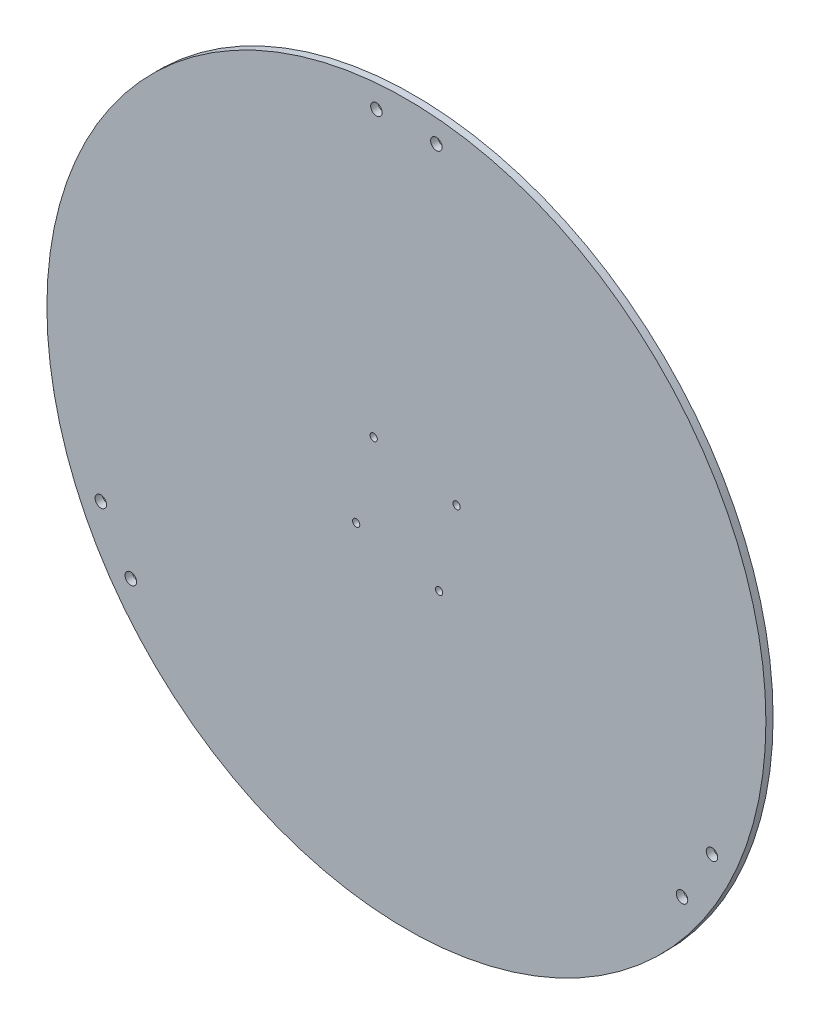
ISO-10303-21;
HEADER;
FILE_DESCRIPTION(('STEP AP214'),'2;1');
FILE_NAME('part.step','',(''),(''),'','','');
FILE_SCHEMA(('AUTOMOTIVE_DESIGN { 1 0 10303 214 1 1 1 1 }'));
ENDSEC;
DATA;
#1=APPLICATION_CONTEXT('core data for automotive mechanical design processes');
#2=APPLICATION_PROTOCOL_DEFINITION('international standard','automotive_design',2000,#1);
#3=PRODUCT_CONTEXT('',#1,'mechanical');
#4=PRODUCT('Part','Part','',(#3));
#5=PRODUCT_RELATED_PRODUCT_CATEGORY('part','',(#4));
#6=PRODUCT_DEFINITION_FORMATION('','',#4);
#7=PRODUCT_DEFINITION_CONTEXT('part definition',#1,'design');
#8=PRODUCT_DEFINITION('design','',#6,#7);
#9=PRODUCT_DEFINITION_SHAPE('','',#8);
#10=(LENGTH_UNIT() NAMED_UNIT(*) SI_UNIT(.MILLI.,.METRE.));
#11=(NAMED_UNIT(*) PLANE_ANGLE_UNIT() SI_UNIT($,.RADIAN.));
#12=(NAMED_UNIT(*) SI_UNIT($,.STERADIAN.) SOLID_ANGLE_UNIT());
#13=UNCERTAINTY_MEASURE_WITH_UNIT(LENGTH_MEASURE(1.E-05),#10,'distance_accuracy_value','');
#14=(GEOMETRIC_REPRESENTATION_CONTEXT(3) GLOBAL_UNCERTAINTY_ASSIGNED_CONTEXT((#13)) GLOBAL_UNIT_ASSIGNED_CONTEXT((#10,
#11,#12)) REPRESENTATION_CONTEXT('',''));
#15=CARTESIAN_POINT('',(0.,0.,0.));
#16=DIRECTION('',(0.,0.,1.));
#17=DIRECTION('',(1.,0.,0.));
#18=AXIS2_PLACEMENT_3D('',#15,#16,#17);
#19=CARTESIAN_POINT('',(0.,8.74300631892311E-13,3.));
#20=DIRECTION('',(0.,0.,1.));
#21=DIRECTION('',(1.,0.,0.));
#22=AXIS2_PLACEMENT_3D('',#19,#20,#21);
#23=PLANE('',#22);
#24=CARTESIAN_POINT('',(20.9486186436359,13.6438769022421,3.));
#25=DIRECTION('',(0.,0.,-1.));
#26=DIRECTION('',(-1.,0.,0.));
#27=AXIS2_PLACEMENT_3D('',#24,#25,#26);
#28=CIRCLE('',#27,1.5);
#29=CARTESIAN_POINT('',(19.4486186436359,13.6438769022421,3.));
#30=VERTEX_POINT('',#29);
#31=EDGE_CURVE('E140',#30,#30,#28,.T.);
#32=ORIENTED_EDGE('',*,*,#31,.T.);
#33=EDGE_LOOP('',(#32));
#34=FACE_BOUND('',#33,.T.);
#35=CARTESIAN_POINT('',(-13.6438769022413,20.9486186436367,3.));
#36=DIRECTION('',(0.,0.,-1.));
#37=DIRECTION('',(-1.,0.,0.));
#38=AXIS2_PLACEMENT_3D('',#35,#36,#37);
#39=CIRCLE('',#38,1.5);
#40=CARTESIAN_POINT('',(-15.1438769022413,20.9486186436367,3.));
#41=VERTEX_POINT('',#40);
#42=EDGE_CURVE('E128',#41,#41,#39,.T.);
#43=ORIENTED_EDGE('',*,*,#42,.T.);
#44=EDGE_LOOP('',(#43));
#45=FACE_BOUND('',#44,.T.);
#46=CARTESIAN_POINT('',(-20.9486186436359,-13.6438769022405,3.));
#47=DIRECTION('',(0.,0.,-1.));
#48=DIRECTION('',(-1.,0.,0.));
#49=AXIS2_PLACEMENT_3D('',#46,#47,#48);
#50=CIRCLE('',#49,1.5);
#51=CARTESIAN_POINT('',(-22.4486186436359,-13.6438769022405,3.));
#52=VERTEX_POINT('',#51);
#53=EDGE_CURVE('E116',#52,#52,#50,.T.);
#54=ORIENTED_EDGE('',*,*,#53,.T.);
#55=EDGE_LOOP('',(#54));
#56=FACE_BOUND('',#55,.T.);
#57=CARTESIAN_POINT('',(13.6438769022413,-20.9486186436351,3.));
#58=DIRECTION('',(0.,0.,-1.));
#59=DIRECTION('',(-1.,0.,0.));
#60=AXIS2_PLACEMENT_3D('',#57,#58,#59);
#61=CIRCLE('',#60,1.5);
#62=CARTESIAN_POINT('',(12.1438769022413,-20.9486186436351,3.));
#63=VERTEX_POINT('',#62);
#64=EDGE_CURVE('E101',#63,#63,#61,.T.);
#65=ORIENTED_EDGE('',*,*,#64,.T.);
#66=EDGE_LOOP('',(#65));
#67=FACE_BOUND('',#66,.T.);
#68=CARTESIAN_POINT('',(-127.493556529821,-59.1746824526946,3.));
#69=DIRECTION('',(0.,0.,1.));
#70=DIRECTION('',(1.,0.,0.));
#71=AXIS2_PLACEMENT_3D('',#68,#69,#70);
#72=CIRCLE('',#71,2.4);
#73=CARTESIAN_POINT('',(-125.093556529821,-59.1746824526946,3.));
#74=VERTEX_POINT('',#73);
#75=EDGE_CURVE('E85',#74,#74,#72,.T.);
#76=ORIENTED_EDGE('',*,*,#75,.F.);
#77=EDGE_LOOP('',(#76));
#78=FACE_BOUND('',#77,.T.);
#79=CARTESIAN_POINT('',(114.993556529821,-80.8253175473055,3.));
#80=DIRECTION('',(0.,0.,1.));
#81=DIRECTION('',(1.,0.,0.));
#82=AXIS2_PLACEMENT_3D('',#79,#80,#81);
#83=CIRCLE('',#82,2.4);
#84=CARTESIAN_POINT('',(117.393556529821,-80.8253175473055,3.));
#85=VERTEX_POINT('',#84);
#86=EDGE_CURVE('E69',#85,#85,#83,.T.);
#87=ORIENTED_EDGE('',*,*,#86,.F.);
#88=EDGE_LOOP('',(#87));
#89=FACE_BOUND('',#88,.T.);
#90=CARTESIAN_POINT('',(12.5,140.,3.));
#91=DIRECTION('',(0.,0.,1.));
#92=DIRECTION('',(1.,0.,0.));
#93=AXIS2_PLACEMENT_3D('',#90,#91,#92);
#94=CIRCLE('',#93,2.4);
#95=CARTESIAN_POINT('',(14.9,140.,3.));
#96=VERTEX_POINT('',#95);
#97=EDGE_CURVE('E55',#96,#96,#94,.T.);
#98=ORIENTED_EDGE('',*,*,#97,.F.);
#99=EDGE_LOOP('',(#98));
#100=FACE_BOUND('',#99,.T.);
#101=CARTESIAN_POINT('',(0.,8.74300631892311E-13,3.));
#102=DIRECTION('',(0.,0.,1.));
#103=DIRECTION('',(1.,0.,0.));
#104=AXIS2_PLACEMENT_3D('',#101,#102,#103);
#105=CIRCLE('',#104,150.000000000006);
#106=CARTESIAN_POINT('',(150.000000000006,8.74300631892311E-13,3.));
#107=VERTEX_POINT('',#106);
#108=EDGE_CURVE('E10',#107,#107,#105,.T.);
#109=ORIENTED_EDGE('',*,*,#108,.T.);
#110=EDGE_LOOP('',(#109));
#111=FACE_BOUND('',#110,.T.);
#112=CARTESIAN_POINT('',(-12.5,140.,3.));
#113=DIRECTION('',(0.,0.,1.));
#114=DIRECTION('',(1.,0.,0.));
#115=AXIS2_PLACEMENT_3D('',#112,#113,#114);
#116=CIRCLE('',#115,2.4);
#117=CARTESIAN_POINT('',(-10.1,140.,3.));
#118=VERTEX_POINT('',#117);
#119=EDGE_CURVE('E61',#118,#118,#116,.T.);
#120=ORIENTED_EDGE('',*,*,#119,.F.);
#121=EDGE_LOOP('',(#120));
#122=FACE_BOUND('',#121,.T.);
#123=CARTESIAN_POINT('',(127.493556529821,-59.1746824526945,3.));
#124=DIRECTION('',(0.,0.,1.));
#125=DIRECTION('',(1.,0.,0.));
#126=AXIS2_PLACEMENT_3D('',#123,#124,#125);
#127=CIRCLE('',#126,2.4);
#128=CARTESIAN_POINT('',(129.893556529821,-59.1746824526945,3.));
#129=VERTEX_POINT('',#128);
#130=EDGE_CURVE('E77',#129,#129,#127,.T.);
#131=ORIENTED_EDGE('',*,*,#130,.F.);
#132=EDGE_LOOP('',(#131));
#133=FACE_BOUND('',#132,.T.);
#134=CARTESIAN_POINT('',(-114.993556529821,-80.8253175473055,3.));
#135=DIRECTION('',(0.,0.,1.));
#136=DIRECTION('',(1.,0.,0.));
#137=AXIS2_PLACEMENT_3D('',#134,#135,#136);
#138=CIRCLE('',#137,2.4);
#139=CARTESIAN_POINT('',(-112.593556529821,-80.8253175473055,3.));
#140=VERTEX_POINT('',#139);
#141=EDGE_CURVE('E93',#140,#140,#138,.T.);
#142=ORIENTED_EDGE('',*,*,#141,.F.);
#143=EDGE_LOOP('',(#142));
#144=FACE_BOUND('',#143,.T.);
#145=ADVANCED_FACE('F42',(#34,#45,#56,#67,#78,#89,#100,#111,#122,#133,#144),#23,.T.);
#146=CARTESIAN_POINT('',(0.,8.74300631892311E-13,0.));
#147=DIRECTION('',(0.,0.,1.));
#148=DIRECTION('',(1.,0.,0.));
#149=AXIS2_PLACEMENT_3D('',#146,#147,#148);
#150=PLANE('',#149);
#151=CARTESIAN_POINT('',(20.9486186436359,13.6438769022421,0.));
#152=DIRECTION('',(0.,0.,-1.));
#153=DIRECTION('',(-1.,0.,0.));
#154=AXIS2_PLACEMENT_3D('',#151,#152,#153);
#155=CIRCLE('',#154,1.525);
#156=CARTESIAN_POINT('',(19.4236186436359,13.6438769022421,0.));
#157=VERTEX_POINT('',#156);
#158=EDGE_CURVE('E148',#157,#157,#155,.T.);
#159=ORIENTED_EDGE('',*,*,#158,.F.);
#160=EDGE_LOOP('',(#159));
#161=FACE_BOUND('',#160,.T.);
#162=CARTESIAN_POINT('',(-13.6438769022413,20.9486186436367,0.));
#163=DIRECTION('',(0.,0.,-1.));
#164=DIRECTION('',(-1.,0.,0.));
#165=AXIS2_PLACEMENT_3D('',#162,#163,#164);
#166=CIRCLE('',#165,1.525);
#167=CARTESIAN_POINT('',(-15.1688769022413,20.9486186436367,0.));
#168=VERTEX_POINT('',#167);
#169=EDGE_CURVE('E136',#168,#168,#166,.T.);
#170=ORIENTED_EDGE('',*,*,#169,.F.);
#171=EDGE_LOOP('',(#170));
#172=FACE_BOUND('',#171,.T.);
#173=CARTESIAN_POINT('',(-20.9486186436359,-13.6438769022405,0.));
#174=DIRECTION('',(0.,0.,-1.));
#175=DIRECTION('',(-1.,0.,0.));
#176=AXIS2_PLACEMENT_3D('',#173,#174,#175);
#177=CIRCLE('',#176,1.525);
#178=CARTESIAN_POINT('',(-22.4736186436359,-13.6438769022405,0.));
#179=VERTEX_POINT('',#178);
#180=EDGE_CURVE('E124',#179,#179,#177,.T.);
#181=ORIENTED_EDGE('',*,*,#180,.F.);
#182=EDGE_LOOP('',(#181));
#183=FACE_BOUND('',#182,.T.);
#184=CARTESIAN_POINT('',(13.6438769022413,-20.9486186436351,0.));
#185=DIRECTION('',(0.,0.,-1.));
#186=DIRECTION('',(-1.,0.,0.));
#187=AXIS2_PLACEMENT_3D('',#184,#185,#186);
#188=CIRCLE('',#187,1.525);
#189=CARTESIAN_POINT('',(12.1188769022413,-20.9486186436351,0.));
#190=VERTEX_POINT('',#189);
#191=EDGE_CURVE('E112',#190,#190,#188,.T.);
#192=ORIENTED_EDGE('',*,*,#191,.F.);
#193=EDGE_LOOP('',(#192));
#194=FACE_BOUND('',#193,.T.);
#195=CARTESIAN_POINT('',(0.,8.74300631892311E-13,0.));
#196=DIRECTION('',(0.,0.,1.));
#197=DIRECTION('',(1.,0.,0.));
#198=AXIS2_PLACEMENT_3D('',#195,#196,#197);
#199=CIRCLE('',#198,150.000000000006);
#200=CARTESIAN_POINT('',(150.000000000006,8.74300631892311E-13,0.));
#201=VERTEX_POINT('',#200);
#202=EDGE_CURVE('E46',#201,#201,#199,.T.);
#203=ORIENTED_EDGE('',*,*,#202,.F.);
#204=EDGE_LOOP('',(#203));
#205=FACE_BOUND('',#204,.T.);
#206=CARTESIAN_POINT('',(12.5,140.,0.));
#207=DIRECTION('',(0.,0.,1.));
#208=DIRECTION('',(1.,0.,0.));
#209=AXIS2_PLACEMENT_3D('',#206,#207,#208);
#210=CIRCLE('',#209,2.4);
#211=CARTESIAN_POINT('',(14.9,140.,0.));
#212=VERTEX_POINT('',#211);
#213=EDGE_CURVE('E57',#212,#212,#210,.T.);
#214=ORIENTED_EDGE('',*,*,#213,.T.);
#215=EDGE_LOOP('',(#214));
#216=FACE_BOUND('',#215,.T.);
#217=CARTESIAN_POINT('',(-12.5,140.,0.));
#218=DIRECTION('',(0.,0.,1.));
#219=DIRECTION('',(1.,0.,0.));
#220=AXIS2_PLACEMENT_3D('',#217,#218,#219);
#221=CIRCLE('',#220,2.4);
#222=CARTESIAN_POINT('',(-10.1,140.,0.));
#223=VERTEX_POINT('',#222);
#224=EDGE_CURVE('E65',#223,#223,#221,.T.);
#225=ORIENTED_EDGE('',*,*,#224,.T.);
#226=EDGE_LOOP('',(#225));
#227=FACE_BOUND('',#226,.T.);
#228=CARTESIAN_POINT('',(114.993556529821,-80.8253175473055,0.));
#229=DIRECTION('',(0.,0.,1.));
#230=DIRECTION('',(1.,0.,0.));
#231=AXIS2_PLACEMENT_3D('',#228,#229,#230);
#232=CIRCLE('',#231,2.4);
#233=CARTESIAN_POINT('',(117.393556529821,-80.8253175473055,0.));
#234=VERTEX_POINT('',#233);
#235=EDGE_CURVE('E73',#234,#234,#232,.T.);
#236=ORIENTED_EDGE('',*,*,#235,.T.);
#237=EDGE_LOOP('',(#236));
#238=FACE_BOUND('',#237,.T.);
#239=CARTESIAN_POINT('',(127.493556529821,-59.1746824526945,0.));
#240=DIRECTION('',(0.,0.,1.));
#241=DIRECTION('',(1.,0.,0.));
#242=AXIS2_PLACEMENT_3D('',#239,#240,#241);
#243=CIRCLE('',#242,2.4);
#244=CARTESIAN_POINT('',(129.893556529821,-59.1746824526945,0.));
#245=VERTEX_POINT('',#244);
#246=EDGE_CURVE('E81',#245,#245,#243,.T.);
#247=ORIENTED_EDGE('',*,*,#246,.T.);
#248=EDGE_LOOP('',(#247));
#249=FACE_BOUND('',#248,.T.);
#250=CARTESIAN_POINT('',(-127.493556529821,-59.1746824526946,0.));
#251=DIRECTION('',(0.,0.,1.));
#252=DIRECTION('',(1.,0.,0.));
#253=AXIS2_PLACEMENT_3D('',#250,#251,#252);
#254=CIRCLE('',#253,2.4);
#255=CARTESIAN_POINT('',(-125.093556529821,-59.1746824526946,0.));
#256=VERTEX_POINT('',#255);
#257=EDGE_CURVE('E89',#256,#256,#254,.T.);
#258=ORIENTED_EDGE('',*,*,#257,.T.);
#259=EDGE_LOOP('',(#258));
#260=FACE_BOUND('',#259,.T.);
#261=CARTESIAN_POINT('',(-114.993556529821,-80.8253175473055,0.));
#262=DIRECTION('',(0.,0.,1.));
#263=DIRECTION('',(1.,0.,0.));
#264=AXIS2_PLACEMENT_3D('',#261,#262,#263);
#265=CIRCLE('',#264,2.4);
#266=CARTESIAN_POINT('',(-112.593556529821,-80.8253175473055,0.));
#267=VERTEX_POINT('',#266);
#268=EDGE_CURVE('E97',#267,#267,#265,.T.);
#269=ORIENTED_EDGE('',*,*,#268,.T.);
#270=EDGE_LOOP('',(#269));
#271=FACE_BOUND('',#270,.T.);
#272=ADVANCED_FACE('F155',(#161,#172,#183,#194,#205,#216,#227,#238,#249,#260,#271),#150,.F.);
#273=CARTESIAN_POINT('',(0.,8.74300631892311E-13,3.));
#274=DIRECTION('',(0.,0.,-1.));
#275=DIRECTION('',(-1.,0.,0.));
#276=AXIS2_PLACEMENT_3D('',#273,#274,#275);
#277=CYLINDRICAL_SURFACE('',#276,150.000000000006);
#278=ORIENTED_EDGE('',*,*,#108,.F.);
#279=EDGE_LOOP('',(#278));
#280=FACE_BOUND('',#279,.T.);
#281=ORIENTED_EDGE('',*,*,#202,.T.);
#282=EDGE_LOOP('',(#281));
#283=FACE_BOUND('',#282,.T.);
#284=ADVANCED_FACE('F44',(#280,#283),#277,.T.);
#285=CARTESIAN_POINT('',(12.5,140.,3.));
#286=DIRECTION('',(0.,0.,-1.));
#287=DIRECTION('',(-1.,0.,0.));
#288=AXIS2_PLACEMENT_3D('',#285,#286,#287);
#289=CYLINDRICAL_SURFACE('',#288,2.4);
#290=ORIENTED_EDGE('',*,*,#97,.T.);
#291=EDGE_LOOP('',(#290));
#292=FACE_BOUND('',#291,.T.);
#293=ORIENTED_EDGE('',*,*,#213,.F.);
#294=EDGE_LOOP('',(#293));
#295=FACE_BOUND('',#294,.T.);
#296=ADVANCED_FACE('F201',(#292,#295),#289,.F.);
#297=CARTESIAN_POINT('',(-12.5,140.,3.));
#298=DIRECTION('',(0.,0.,-1.));
#299=DIRECTION('',(-1.,0.,0.));
#300=AXIS2_PLACEMENT_3D('',#297,#298,#299);
#301=CYLINDRICAL_SURFACE('',#300,2.4);
#302=ORIENTED_EDGE('',*,*,#119,.T.);
#303=EDGE_LOOP('',(#302));
#304=FACE_BOUND('',#303,.T.);
#305=ORIENTED_EDGE('',*,*,#224,.F.);
#306=EDGE_LOOP('',(#305));
#307=FACE_BOUND('',#306,.T.);
#308=ADVANCED_FACE('F204',(#304,#307),#301,.F.);
#309=CARTESIAN_POINT('',(114.993556529821,-80.8253175473055,3.));
#310=DIRECTION('',(0.,0.,-1.));
#311=DIRECTION('',(-1.,0.,0.));
#312=AXIS2_PLACEMENT_3D('',#309,#310,#311);
#313=CYLINDRICAL_SURFACE('',#312,2.4);
#314=ORIENTED_EDGE('',*,*,#86,.T.);
#315=EDGE_LOOP('',(#314));
#316=FACE_BOUND('',#315,.T.);
#317=ORIENTED_EDGE('',*,*,#235,.F.);
#318=EDGE_LOOP('',(#317));
#319=FACE_BOUND('',#318,.T.);
#320=ADVANCED_FACE('F208',(#316,#319),#313,.F.);
#321=CARTESIAN_POINT('',(127.493556529821,-59.1746824526945,3.));
#322=DIRECTION('',(0.,0.,-1.));
#323=DIRECTION('',(-1.,0.,0.));
#324=AXIS2_PLACEMENT_3D('',#321,#322,#323);
#325=CYLINDRICAL_SURFACE('',#324,2.4);
#326=ORIENTED_EDGE('',*,*,#130,.T.);
#327=EDGE_LOOP('',(#326));
#328=FACE_BOUND('',#327,.T.);
#329=ORIENTED_EDGE('',*,*,#246,.F.);
#330=EDGE_LOOP('',(#329));
#331=FACE_BOUND('',#330,.T.);
#332=ADVANCED_FACE('F192',(#328,#331),#325,.F.);
#333=CARTESIAN_POINT('',(-127.493556529821,-59.1746824526946,3.));
#334=DIRECTION('',(0.,0.,-1.));
#335=DIRECTION('',(-1.,0.,0.));
#336=AXIS2_PLACEMENT_3D('',#333,#334,#335);
#337=CYLINDRICAL_SURFACE('',#336,2.4);
#338=ORIENTED_EDGE('',*,*,#75,.T.);
#339=EDGE_LOOP('',(#338));
#340=FACE_BOUND('',#339,.T.);
#341=ORIENTED_EDGE('',*,*,#257,.F.);
#342=EDGE_LOOP('',(#341));
#343=FACE_BOUND('',#342,.T.);
#344=ADVANCED_FACE('F181',(#340,#343),#337,.F.);
#345=CARTESIAN_POINT('',(-114.993556529821,-80.8253175473055,3.));
#346=DIRECTION('',(0.,0.,-1.));
#347=DIRECTION('',(-1.,0.,0.));
#348=AXIS2_PLACEMENT_3D('',#345,#346,#347);
#349=CYLINDRICAL_SURFACE('',#348,2.4);
#350=ORIENTED_EDGE('',*,*,#141,.T.);
#351=EDGE_LOOP('',(#350));
#352=FACE_BOUND('',#351,.T.);
#353=ORIENTED_EDGE('',*,*,#268,.F.);
#354=EDGE_LOOP('',(#353));
#355=FACE_BOUND('',#354,.T.);
#356=ADVANCED_FACE('F178',(#352,#355),#349,.F.);
#357=CARTESIAN_POINT('',(13.6438769022413,-20.9486186436351,0.));
#358=DIRECTION('',(0.,0.,-1.));
#359=DIRECTION('',(-1.,0.,0.));
#360=AXIS2_PLACEMENT_3D('',#357,#358,#359);
#361=CYLINDRICAL_SURFACE('',#360,1.49999999999999);
#362=ORIENTED_EDGE('',*,*,#64,.F.);
#363=EDGE_LOOP('',(#362));
#364=FACE_BOUND('',#363,.T.);
#365=CARTESIAN_POINT('',(13.6438769022413,-20.9486186436351,0.0249999999999972));
#366=DIRECTION('',(0.,0.,-1.));
#367=DIRECTION('',(-1.,0.,0.));
#368=AXIS2_PLACEMENT_3D('',#365,#366,#367);
#369=CIRCLE('',#368,1.49999999999999);
#370=CARTESIAN_POINT('',(12.1438769022413,-20.9486186436351,0.0249999999999972));
#371=VERTEX_POINT('',#370);
#372=EDGE_CURVE('E108',#371,#371,#369,.T.);
#373=ORIENTED_EDGE('',*,*,#372,.T.);
#374=EDGE_LOOP('',(#373));
#375=FACE_BOUND('',#374,.T.);
#376=ADVANCED_FACE('F180',(#364,#375),#361,.F.);
#377=CARTESIAN_POINT('',(13.6438769022413,-20.9486186436351,0.));
#378=DIRECTION('',(0.,0.,-1.));
#379=DIRECTION('',(-1.,0.,0.));
#380=AXIS2_PLACEMENT_3D('',#377,#378,#379);
#381=CONICAL_SURFACE('',#380,1.525,0.785398163397726);
#382=ORIENTED_EDGE('',*,*,#372,.F.);
#383=EDGE_LOOP('',(#382));
#384=FACE_BOUND('',#383,.T.);
#385=ORIENTED_EDGE('',*,*,#191,.T.);
#386=EDGE_LOOP('',(#385));
#387=FACE_BOUND('',#386,.T.);
#388=ADVANCED_FACE('F189',(#384,#387),#381,.F.);
#389=CARTESIAN_POINT('',(-20.9486186436359,-13.6438769022405,0.));
#390=DIRECTION('',(0.,0.,-1.));
#391=DIRECTION('',(-1.,0.,0.));
#392=AXIS2_PLACEMENT_3D('',#389,#390,#391);
#393=CYLINDRICAL_SURFACE('',#392,1.49999999999999);
#394=ORIENTED_EDGE('',*,*,#53,.F.);
#395=EDGE_LOOP('',(#394));
#396=FACE_BOUND('',#395,.T.);
#397=CARTESIAN_POINT('',(-20.9486186436359,-13.6438769022405,0.0249999999999972));
#398=DIRECTION('',(0.,0.,-1.));
#399=DIRECTION('',(-1.,0.,0.));
#400=AXIS2_PLACEMENT_3D('',#397,#398,#399);
#401=CIRCLE('',#400,1.49999999999999);
#402=CARTESIAN_POINT('',(-22.4486186436359,-13.6438769022405,0.0249999999999972));
#403=VERTEX_POINT('',#402);
#404=EDGE_CURVE('E120',#403,#403,#401,.T.);
#405=ORIENTED_EDGE('',*,*,#404,.T.);
#406=EDGE_LOOP('',(#405));
#407=FACE_BOUND('',#406,.T.);
#408=ADVANCED_FACE('F249',(#396,#407),#393,.F.);
#409=CARTESIAN_POINT('',(-20.9486186436359,-13.6438769022405,0.));
#410=DIRECTION('',(0.,0.,-1.));
#411=DIRECTION('',(-1.,0.,0.));
#412=AXIS2_PLACEMENT_3D('',#409,#410,#411);
#413=CONICAL_SURFACE('',#412,1.525,0.785398163397691);
#414=ORIENTED_EDGE('',*,*,#404,.F.);
#415=EDGE_LOOP('',(#414));
#416=FACE_BOUND('',#415,.T.);
#417=ORIENTED_EDGE('',*,*,#180,.T.);
#418=EDGE_LOOP('',(#417));
#419=FACE_BOUND('',#418,.T.);
#420=ADVANCED_FACE('F259',(#416,#419),#413,.F.);
#421=CARTESIAN_POINT('',(-13.6438769022413,20.9486186436367,0.));
#422=DIRECTION('',(0.,0.,-1.));
#423=DIRECTION('',(-1.,0.,0.));
#424=AXIS2_PLACEMENT_3D('',#421,#422,#423);
#425=CYLINDRICAL_SURFACE('',#424,1.49999999999999);
#426=ORIENTED_EDGE('',*,*,#42,.F.);
#427=EDGE_LOOP('',(#426));
#428=FACE_BOUND('',#427,.T.);
#429=CARTESIAN_POINT('',(-13.6438769022413,20.9486186436367,0.0249999999999972));
#430=DIRECTION('',(0.,0.,-1.));
#431=DIRECTION('',(-1.,0.,0.));
#432=AXIS2_PLACEMENT_3D('',#429,#430,#431);
#433=CIRCLE('',#432,1.49999999999999);
#434=CARTESIAN_POINT('',(-15.1438769022413,20.9486186436367,0.0249999999999972));
#435=VERTEX_POINT('',#434);
#436=EDGE_CURVE('E132',#435,#435,#433,.T.);
#437=ORIENTED_EDGE('',*,*,#436,.T.);
#438=EDGE_LOOP('',(#437));
#439=FACE_BOUND('',#438,.T.);
#440=ADVANCED_FACE('F269',(#428,#439),#425,.F.);
#441=CARTESIAN_POINT('',(-13.6438769022413,20.9486186436367,0.));
#442=DIRECTION('',(0.,0.,-1.));
#443=DIRECTION('',(-1.,0.,0.));
#444=AXIS2_PLACEMENT_3D('',#441,#442,#443);
#445=CONICAL_SURFACE('',#444,1.525,0.785398163397726);
#446=ORIENTED_EDGE('',*,*,#436,.F.);
#447=EDGE_LOOP('',(#446));
#448=FACE_BOUND('',#447,.T.);
#449=ORIENTED_EDGE('',*,*,#169,.T.);
#450=EDGE_LOOP('',(#449));
#451=FACE_BOUND('',#450,.T.);
#452=ADVANCED_FACE('F279',(#448,#451),#445,.F.);
#453=CARTESIAN_POINT('',(20.9486186436359,13.6438769022421,0.));
#454=DIRECTION('',(0.,0.,-1.));
#455=DIRECTION('',(-1.,0.,0.));
#456=AXIS2_PLACEMENT_3D('',#453,#454,#455);
#457=CYLINDRICAL_SURFACE('',#456,1.49999999999999);
#458=ORIENTED_EDGE('',*,*,#31,.F.);
#459=EDGE_LOOP('',(#458));
#460=FACE_BOUND('',#459,.T.);
#461=CARTESIAN_POINT('',(20.9486186436359,13.6438769022421,0.0249999999999972));
#462=DIRECTION('',(0.,0.,-1.));
#463=DIRECTION('',(-1.,0.,0.));
#464=AXIS2_PLACEMENT_3D('',#461,#462,#463);
#465=CIRCLE('',#464,1.49999999999999);
#466=CARTESIAN_POINT('',(19.4486186436359,13.6438769022421,0.0249999999999972));
#467=VERTEX_POINT('',#466);
#468=EDGE_CURVE('E144',#467,#467,#465,.T.);
#469=ORIENTED_EDGE('',*,*,#468,.T.);
#470=EDGE_LOOP('',(#469));
#471=FACE_BOUND('',#470,.T.);
#472=ADVANCED_FACE('F289',(#460,#471),#457,.F.);
#473=CARTESIAN_POINT('',(20.9486186436359,13.6438769022421,0.));
#474=DIRECTION('',(0.,0.,-1.));
#475=DIRECTION('',(-1.,0.,0.));
#476=AXIS2_PLACEMENT_3D('',#473,#474,#475);
#477=CONICAL_SURFACE('',#476,1.525,0.785398163397691);
#478=ORIENTED_EDGE('',*,*,#468,.F.);
#479=EDGE_LOOP('',(#478));
#480=FACE_BOUND('',#479,.T.);
#481=ORIENTED_EDGE('',*,*,#158,.T.);
#482=EDGE_LOOP('',(#481));
#483=FACE_BOUND('',#482,.T.);
#484=ADVANCED_FACE('F153',(#480,#483),#477,.F.);
#485=CLOSED_SHELL('',(#145,#272,#284,#296,#308,#320,#332,#344,#356,#376,#388,#408,#420,#440,
#452,#472,#484));
#486=MANIFOLD_SOLID_BREP('B2',#485);
#487=ADVANCED_BREP_SHAPE_REPRESENTATION('',(#18,#486),#14);
#488=SHAPE_DEFINITION_REPRESENTATION(#9,#487);
ENDSEC;
END-ISO-10303-21;
